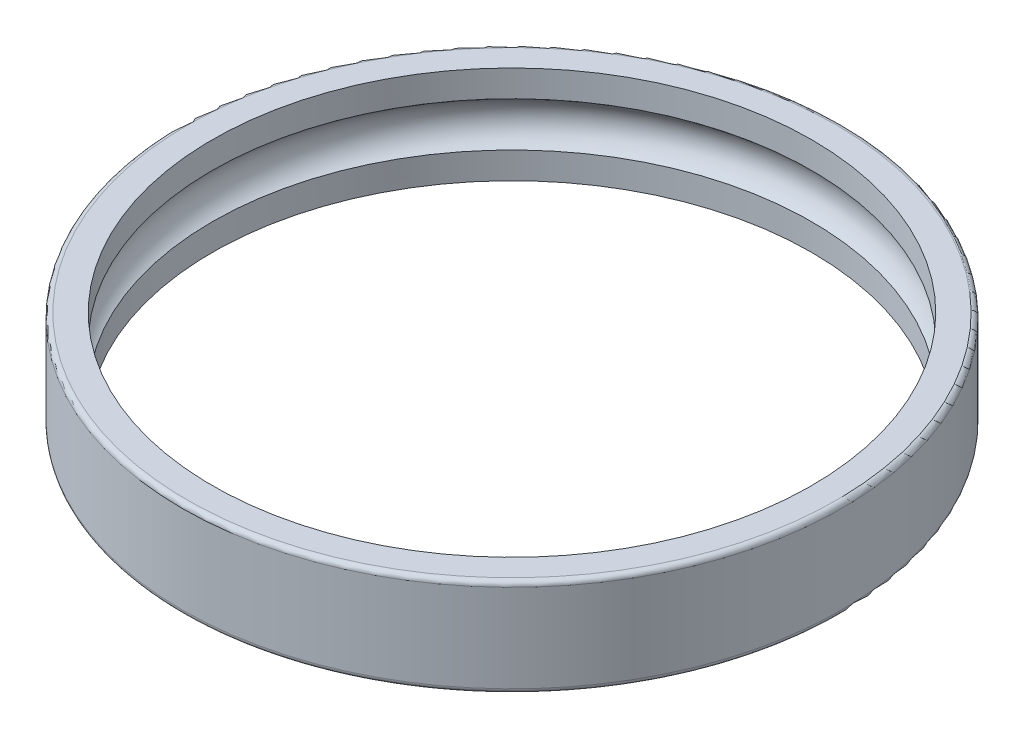
ISO-10303-21;
HEADER;
FILE_DESCRIPTION(('STEP AP214'),'2;1');
FILE_NAME('part.step','',(''),(''),'','','');
FILE_SCHEMA(('AUTOMOTIVE_DESIGN { 1 0 10303 214 1 1 1 1 }'));
ENDSEC;
DATA;
#1=APPLICATION_CONTEXT('core data for automotive mechanical design processes');
#2=APPLICATION_PROTOCOL_DEFINITION('international standard','automotive_design',2000,#1);
#3=PRODUCT_CONTEXT('',#1,'mechanical');
#4=PRODUCT('Part','Part','',(#3));
#5=PRODUCT_RELATED_PRODUCT_CATEGORY('part','',(#4));
#6=PRODUCT_DEFINITION_FORMATION('','',#4);
#7=PRODUCT_DEFINITION_CONTEXT('part definition',#1,'design');
#8=PRODUCT_DEFINITION('design','',#6,#7);
#9=PRODUCT_DEFINITION_SHAPE('','',#8);
#10=(LENGTH_UNIT() NAMED_UNIT(*) SI_UNIT(.MILLI.,.METRE.));
#11=(NAMED_UNIT(*) PLANE_ANGLE_UNIT() SI_UNIT($,.RADIAN.));
#12=(NAMED_UNIT(*) SI_UNIT($,.STERADIAN.) SOLID_ANGLE_UNIT());
#13=UNCERTAINTY_MEASURE_WITH_UNIT(LENGTH_MEASURE(1.E-05),#10,'distance_accuracy_value','');
#14=(GEOMETRIC_REPRESENTATION_CONTEXT(3) GLOBAL_UNCERTAINTY_ASSIGNED_CONTEXT((#13)) GLOBAL_UNIT_ASSIGNED_CONTEXT((#10,
#11,#12)) REPRESENTATION_CONTEXT('',''));
#15=CARTESIAN_POINT('',(0.,0.,0.));
#16=DIRECTION('',(0.,0.,1.));
#17=DIRECTION('',(1.,0.,0.));
#18=AXIS2_PLACEMENT_3D('',#15,#16,#17);
#19=CARTESIAN_POINT('',(0.,-0.54533666301317,0.));
#20=DIRECTION('',(0.,1.,0.));
#21=DIRECTION('',(0.,0.,1.));
#22=AXIS2_PLACEMENT_3D('',#19,#20,#21);
#23=CYLINDRICAL_SURFACE('',#22,12.275);
#24=CARTESIAN_POINT('',(0.,-1.09067332602634,0.));
#25=DIRECTION('',(0.,1.,0.));
#26=DIRECTION('',(0.,0.,1.));
#27=AXIS2_PLACEMENT_3D('',#24,#25,#26);
#28=CIRCLE('',#27,12.275);
#29=CARTESIAN_POINT('',(2.323059024524,-1.09067332602634,12.0531747588997));
#30=VERTEX_POINT('',#29);
#31=EDGE_CURVE('E84',#30,#30,#28,.T.);
#32=ORIENTED_EDGE('',*,*,#31,.F.);
#33=EDGE_LOOP('',(#32));
#34=FACE_BOUND('',#33,.T.);
#35=CARTESIAN_POINT('',(0.,0.,0.));
#36=DIRECTION('',(0.,1.,0.));
#37=DIRECTION('',(0.,0.,1.));
#38=AXIS2_PLACEMENT_3D('',#35,#36,#37);
#39=CIRCLE('',#38,12.275);
#40=CARTESIAN_POINT('',(0.,0.,-12.275));
#41=VERTEX_POINT('',#40);
#42=EDGE_CURVE('E11',#41,#41,#39,.T.);
#43=ORIENTED_EDGE('',*,*,#42,.T.);
#44=EDGE_LOOP('',(#43));
#45=FACE_BOUND('',#44,.T.);
#46=ADVANCED_FACE('F17',(#34,#45),#23,.F.);
#47=CARTESIAN_POINT('',(0.,0.,12.7875));
#48=DIRECTION('',(0.,1.,0.));
#49=DIRECTION('',(1.,0.,0.));
#50=AXIS2_PLACEMENT_3D('',#47,#48,#49);
#51=PLANE('',#50);
#52=CARTESIAN_POINT('',(0.,0.,0.));
#53=DIRECTION('',(0.,1.,0.));
#54=DIRECTION('',(0.,0.,1.));
#55=AXIS2_PLACEMENT_3D('',#52,#53,#54);
#56=CIRCLE('',#55,13.3);
#57=CARTESIAN_POINT('',(0.,0.,-13.3));
#58=VERTEX_POINT('',#57);
#59=EDGE_CURVE('E88',#58,#58,#56,.T.);
#60=ORIENTED_EDGE('',*,*,#59,.T.);
#61=EDGE_LOOP('',(#60));
#62=FACE_BOUND('',#61,.T.);
#63=ORIENTED_EDGE('',*,*,#42,.F.);
#64=EDGE_LOOP('',(#63));
#65=FACE_BOUND('',#64,.T.);
#66=ADVANCED_FACE('F104',(#62,#65),#51,.T.);
#67=CARTESIAN_POINT('',(0.,-3.45466333698683,0.));
#68=DIRECTION('',(0.,1.,0.));
#69=DIRECTION('',(0.,0.,1.));
#70=AXIS2_PLACEMENT_3D('',#67,#68,#69);
#71=CYLINDRICAL_SURFACE('',#70,12.275);
#72=CARTESIAN_POINT('',(0.,-4.,0.));
#73=DIRECTION('',(0.,1.,0.));
#74=DIRECTION('',(0.,0.,1.));
#75=AXIS2_PLACEMENT_3D('',#72,#73,#74);
#76=CIRCLE('',#75,12.275);
#77=CARTESIAN_POINT('',(0.,-4.,-12.275));
#78=VERTEX_POINT('',#77);
#79=EDGE_CURVE('E28',#78,#78,#76,.T.);
#80=ORIENTED_EDGE('',*,*,#79,.F.);
#81=EDGE_LOOP('',(#80));
#82=FACE_BOUND('',#81,.T.);
#83=CARTESIAN_POINT('',(0.,-2.90932667397366,0.));
#84=DIRECTION('',(0.,1.,0.));
#85=DIRECTION('',(0.,0.,1.));
#86=AXIS2_PLACEMENT_3D('',#83,#84,#85);
#87=CIRCLE('',#86,12.275);
#88=CARTESIAN_POINT('',(4.56215664323048,-2.90932667397366,11.3957163777723));
#89=VERTEX_POINT('',#88);
#90=EDGE_CURVE('E87',#89,#89,#87,.T.);
#91=ORIENTED_EDGE('',*,*,#90,.T.);
#92=EDGE_LOOP('',(#91));
#93=FACE_BOUND('',#92,.T.);
#94=ADVANCED_FACE('F101',(#82,#93),#71,.F.);
#95=CARTESIAN_POINT('',(0.,-4.,12.7875));
#96=DIRECTION('',(0.,-1.,0.));
#97=DIRECTION('',(-1.,0.,0.));
#98=AXIS2_PLACEMENT_3D('',#95,#96,#97);
#99=PLANE('',#98);
#100=ORIENTED_EDGE('',*,*,#79,.T.);
#101=EDGE_LOOP('',(#100));
#102=FACE_BOUND('',#101,.T.);
#103=CARTESIAN_POINT('',(0.,-4.,0.));
#104=DIRECTION('',(0.,1.,0.));
#105=DIRECTION('',(0.,0.,1.));
#106=AXIS2_PLACEMENT_3D('',#103,#104,#105);
#107=CIRCLE('',#106,13.3);
#108=CARTESIAN_POINT('',(0.,-4.,-13.3));
#109=VERTEX_POINT('',#108);
#110=EDGE_CURVE('E78',#109,#109,#107,.T.);
#111=ORIENTED_EDGE('',*,*,#110,.F.);
#112=EDGE_LOOP('',(#111));
#113=FACE_BOUND('',#112,.T.);
#114=ADVANCED_FACE('F98',(#102,#113),#99,.T.);
#115=CARTESIAN_POINT('',(0.,-0.2,0.));
#116=DIRECTION('',(0.,1.,0.));
#117=DIRECTION('',(0.,0.,1.));
#118=AXIS2_PLACEMENT_3D('',#115,#116,#117);
#119=TOROIDAL_SURFACE('',#118,13.3,0.2);
#120=ORIENTED_EDGE('',*,*,#59,.F.);
#121=EDGE_LOOP('',(#120));
#122=FACE_BOUND('',#121,.T.);
#123=CARTESIAN_POINT('',(0.,-0.2,0.));
#124=DIRECTION('',(0.,1.,0.));
#125=DIRECTION('',(0.,0.,1.));
#126=AXIS2_PLACEMENT_3D('',#123,#124,#125);
#127=CIRCLE('',#126,13.5);
#128=CARTESIAN_POINT('',(0.,-0.2,-13.5));
#129=VERTEX_POINT('',#128);
#130=EDGE_CURVE('E62',#129,#129,#127,.T.);
#131=ORIENTED_EDGE('',*,*,#130,.T.);
#132=EDGE_LOOP('',(#131));
#133=FACE_BOUND('',#132,.T.);
#134=ADVANCED_FACE('F112',(#122,#133),#119,.T.);
#135=CARTESIAN_POINT('',(0.,-2.,0.));
#136=DIRECTION('',(0.,1.,0.));
#137=DIRECTION('',(0.,0.,1.));
#138=AXIS2_PLACEMENT_3D('',#135,#136,#137);
#139=TOROIDAL_SURFACE('',#138,11.75,1.05);
#140=ORIENTED_EDGE('',*,*,#90,.F.);
#141=EDGE_LOOP('',(#140));
#142=FACE_BOUND('',#141,.T.);
#143=ORIENTED_EDGE('',*,*,#31,.T.);
#144=EDGE_LOOP('',(#143));
#145=FACE_BOUND('',#144,.T.);
#146=ADVANCED_FACE('F108',(#142,#145),#139,.F.);
#147=CARTESIAN_POINT('',(0.,-3.8,0.));
#148=DIRECTION('',(0.,1.,0.));
#149=DIRECTION('',(0.,0.,1.));
#150=AXIS2_PLACEMENT_3D('',#147,#148,#149);
#151=TOROIDAL_SURFACE('',#150,13.3,0.2);
#152=CARTESIAN_POINT('',(0.,-3.8,0.));
#153=DIRECTION('',(0.,1.,0.));
#154=DIRECTION('',(0.,0.,1.));
#155=AXIS2_PLACEMENT_3D('',#152,#153,#154);
#156=CIRCLE('',#155,13.5);
#157=CARTESIAN_POINT('',(0.,-3.8,-13.5));
#158=VERTEX_POINT('',#157);
#159=EDGE_CURVE('E21',#158,#158,#156,.T.);
#160=ORIENTED_EDGE('',*,*,#159,.F.);
#161=EDGE_LOOP('',(#160));
#162=FACE_BOUND('',#161,.T.);
#163=ORIENTED_EDGE('',*,*,#110,.T.);
#164=EDGE_LOOP('',(#163));
#165=FACE_BOUND('',#164,.T.);
#166=ADVANCED_FACE('F111',(#162,#165),#151,.T.);
#167=CARTESIAN_POINT('',(0.,-2.,0.));
#168=DIRECTION('',(0.,1.,0.));
#169=DIRECTION('',(0.,0.,1.));
#170=AXIS2_PLACEMENT_3D('',#167,#168,#169);
#171=CYLINDRICAL_SURFACE('',#170,13.5);
#172=ORIENTED_EDGE('',*,*,#130,.F.);
#173=EDGE_LOOP('',(#172));
#174=FACE_BOUND('',#173,.T.);
#175=ORIENTED_EDGE('',*,*,#159,.T.);
#176=EDGE_LOOP('',(#175));
#177=FACE_BOUND('',#176,.T.);
#178=ADVANCED_FACE('F19',(#174,#177),#171,.T.);
#179=CLOSED_SHELL('',(#46,#66,#94,#114,#134,#146,#166,#178));
#180=MANIFOLD_SOLID_BREP('B1',#179);
#181=ADVANCED_BREP_SHAPE_REPRESENTATION('',(#18,#180),#14);
#182=SHAPE_DEFINITION_REPRESENTATION(#9,#181);
ENDSEC;
END-ISO-10303-21;
